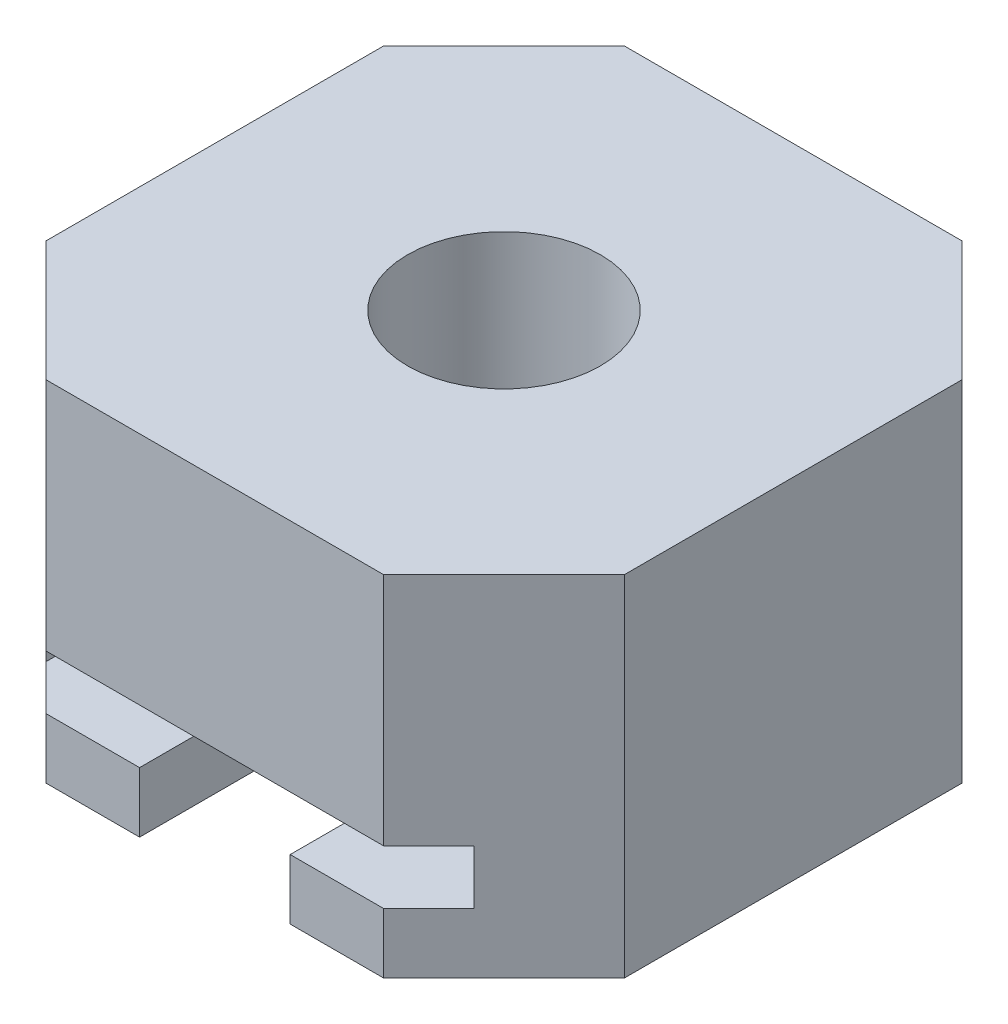
ISO-10303-21;
HEADER;
FILE_DESCRIPTION(('STEP AP214'),'2;1');
FILE_NAME('part.step','',(''),(''),'','','');
FILE_SCHEMA(('AUTOMOTIVE_DESIGN { 1 0 10303 214 1 1 1 1 }'));
ENDSEC;
DATA;
#1=APPLICATION_CONTEXT('core data for automotive mechanical design processes');
#2=APPLICATION_PROTOCOL_DEFINITION('international standard','automotive_design',2000,#1);
#3=PRODUCT_CONTEXT('',#1,'mechanical');
#4=PRODUCT('Part','Part','',(#3));
#5=PRODUCT_RELATED_PRODUCT_CATEGORY('part','',(#4));
#6=PRODUCT_DEFINITION_FORMATION('','',#4);
#7=PRODUCT_DEFINITION_CONTEXT('part definition',#1,'design');
#8=PRODUCT_DEFINITION('design','',#6,#7);
#9=PRODUCT_DEFINITION_SHAPE('','',#8);
#10=(LENGTH_UNIT() NAMED_UNIT(*) SI_UNIT(.MILLI.,.METRE.));
#11=(NAMED_UNIT(*) PLANE_ANGLE_UNIT() SI_UNIT($,.RADIAN.));
#12=(NAMED_UNIT(*) SI_UNIT($,.STERADIAN.) SOLID_ANGLE_UNIT());
#13=UNCERTAINTY_MEASURE_WITH_UNIT(LENGTH_MEASURE(1.E-05),#10,'distance_accuracy_value','');
#14=(GEOMETRIC_REPRESENTATION_CONTEXT(3) GLOBAL_UNCERTAINTY_ASSIGNED_CONTEXT((#13)) GLOBAL_UNIT_ASSIGNED_CONTEXT((#10,
#11,#12)) REPRESENTATION_CONTEXT('',''));
#15=CARTESIAN_POINT('',(0.,0.,0.));
#16=DIRECTION('',(0.,0.,1.));
#17=DIRECTION('',(1.,0.,0.));
#18=AXIS2_PLACEMENT_3D('',#15,#16,#17);
#19=CARTESIAN_POINT('',(-12.192,12.192,12.1919999999998));
#20=DIRECTION('',(0.,0.,-1.));
#21=DIRECTION('',(-1.,0.,0.));
#22=AXIS2_PLACEMENT_3D('',#19,#20,#21);
#23=PLANE('',#22);
#24=DIRECTION('',(1.,0.,0.));
#25=VECTOR('',#24,1.);
#26=CARTESIAN_POINT('',(-12.192,12.192,12.1919999999998));
#27=LINE('',#26,#25);
#28=CARTESIAN_POINT('',(-7.112,12.192,12.1919999999998));
#29=VERTEX_POINT('',#28);
#30=CARTESIAN_POINT('',(7.11199999999999,12.192,12.1919999999998));
#31=VERTEX_POINT('',#30);
#32=EDGE_CURVE('E227',#29,#31,#27,.T.);
#33=ORIENTED_EDGE('',*,*,#32,.F.);
#34=DIRECTION('',(0.,-1.,0.));
#35=VECTOR('',#34,1.);
#36=CARTESIAN_POINT('',(-7.112,12.192,12.1919999999998));
#37=LINE('',#36,#35);
#38=CARTESIAN_POINT('',(-7.112,2.286,12.1919999999998));
#39=VERTEX_POINT('',#38);
#40=EDGE_CURVE('E295',#29,#39,#37,.T.);
#41=ORIENTED_EDGE('',*,*,#40,.T.);
#42=DIRECTION('',(1.,0.,0.));
#43=VECTOR('',#42,1.);
#44=CARTESIAN_POINT('',(0.,2.286,12.1919999999998));
#45=LINE('',#44,#43);
#46=CARTESIAN_POINT('',(7.11199999999999,2.286,12.1919999999998));
#47=VERTEX_POINT('',#46);
#48=EDGE_CURVE('E374',#39,#47,#45,.T.);
#49=ORIENTED_EDGE('',*,*,#48,.T.);
#50=DIRECTION('',(0.,1.,0.));
#51=VECTOR('',#50,1.);
#52=CARTESIAN_POINT('',(7.11199999999999,12.192,12.1919999999998));
#53=LINE('',#52,#51);
#54=EDGE_CURVE('E286',#47,#31,#53,.T.);
#55=ORIENTED_EDGE('',*,*,#54,.T.);
#56=EDGE_LOOP('',(#33,#41,#49,#55));
#57=FACE_BOUND('',#56,.T.);
#58=ADVANCED_FACE('F43',(#57),#23,.F.);
#59=DIRECTION('',(-1.,0.,0.));
#60=VECTOR('',#59,1.);
#61=CARTESIAN_POINT('',(12.192,-2.54,12.1919999999998));
#62=LINE('',#61,#60);
#63=CARTESIAN_POINT('',(7.11199999999999,-2.54,12.1919999999998));
#64=VERTEX_POINT('',#63);
#65=CARTESIAN_POINT('',(3.175,-2.54,12.1919999999998));
#66=VERTEX_POINT('',#65);
#67=EDGE_CURVE('E346',#64,#66,#62,.T.);
#68=ORIENTED_EDGE('',*,*,#67,.F.);
#69=DIRECTION('',(0.,1.,0.));
#70=VECTOR('',#69,1.);
#71=CARTESIAN_POINT('',(7.11199999999999,12.192,12.1919999999998));
#72=LINE('',#71,#70);
#73=CARTESIAN_POINT('',(7.11199999999999,0.,12.1919999999998));
#74=VERTEX_POINT('',#73);
#75=EDGE_CURVE('E289',#64,#74,#72,.T.);
#76=ORIENTED_EDGE('',*,*,#75,.T.);
#77=DIRECTION('',(1.,0.,0.));
#78=VECTOR('',#77,1.);
#79=CARTESIAN_POINT('',(0.,0.,12.1919999999998));
#80=LINE('',#79,#78);
#81=CARTESIAN_POINT('',(3.175,0.,12.1919999999998));
#82=VERTEX_POINT('',#81);
#83=EDGE_CURVE('E326',#82,#74,#80,.T.);
#84=ORIENTED_EDGE('',*,*,#83,.F.);
#85=DIRECTION('',(0.,-1.,0.));
#86=VECTOR('',#85,1.);
#87=CARTESIAN_POINT('',(3.175,13.7465400737784,12.1919999999998));
#88=LINE('',#87,#86);
#89=EDGE_CURVE('E391',#82,#66,#88,.T.);
#90=ORIENTED_EDGE('',*,*,#89,.T.);
#91=EDGE_LOOP('',(#68,#76,#84,#90));
#92=FACE_BOUND('',#91,.T.);
#93=ADVANCED_FACE('F449',(#92),#23,.F.);
#94=CARTESIAN_POINT('',(-9.017,12.192,-6.096));
#95=DIRECTION('',(0.707106781186544,0.,0.707106781186551));
#96=DIRECTION('',(0.707106781186551,0.,-0.707106781186544));
#97=AXIS2_PLACEMENT_3D('',#94,#95,#96);
#98=PLANE('',#97);
#99=DIRECTION('',(0.,-1.,0.));
#100=VECTOR('',#99,1.);
#101=CARTESIAN_POINT('',(-6.0960000000002,12.192,-9.01699999999977));
#102=LINE('',#101,#100);
#103=CARTESIAN_POINT('',(-6.0960000000002,2.286,-9.01699999999977));
#104=VERTEX_POINT('',#103);
#105=CARTESIAN_POINT('',(-6.0960000000002,0.,-9.01699999999977));
#106=VERTEX_POINT('',#105);
#107=EDGE_CURVE('E216',#104,#106,#102,.T.);
#108=ORIENTED_EDGE('',*,*,#107,.F.);
#109=DIRECTION('',(-0.707106781186551,0.,0.707106781186544));
#110=VECTOR('',#109,1.);
#111=CARTESIAN_POINT('',(-9.017,2.286,-6.096));
#112=LINE('',#111,#110);
#113=CARTESIAN_POINT('',(-9.017,2.286,-6.096));
#114=VERTEX_POINT('',#113);
#115=EDGE_CURVE('E193',#104,#114,#112,.T.);
#116=ORIENTED_EDGE('',*,*,#115,.T.);
#117=DIRECTION('',(0.,-1.,0.));
#118=VECTOR('',#117,1.);
#119=CARTESIAN_POINT('',(-9.017,12.192,-6.096));
#120=LINE('',#119,#118);
#121=CARTESIAN_POINT('',(-9.017,0.,-6.096));
#122=VERTEX_POINT('',#121);
#123=EDGE_CURVE('E220',#114,#122,#120,.T.);
#124=ORIENTED_EDGE('',*,*,#123,.T.);
#125=DIRECTION('',(-0.707106781186551,0.,0.707106781186544));
#126=VECTOR('',#125,1.);
#127=CARTESIAN_POINT('',(-9.017,0.,-6.096));
#128=LINE('',#127,#126);
#129=EDGE_CURVE('E350',#106,#122,#128,.T.);
#130=ORIENTED_EDGE('',*,*,#129,.F.);
#131=EDGE_LOOP('',(#108,#116,#124,#130));
#132=FACE_BOUND('',#131,.T.);
#133=ADVANCED_FACE('F455',(#132),#98,.T.);
#134=CARTESIAN_POINT('',(-9.017,12.192,6.096));
#135=DIRECTION('',(1.,0.,0.));
#136=DIRECTION('',(0.,0.,-1.));
#137=AXIS2_PLACEMENT_3D('',#134,#135,#136);
#138=PLANE('',#137);
#139=DIRECTION('',(0.,0.,1.));
#140=VECTOR('',#139,1.);
#141=CARTESIAN_POINT('',(-9.017,2.286,0.));
#142=LINE('',#141,#140);
#143=CARTESIAN_POINT('',(-9.017,2.286,10.2869999999998));
#144=VERTEX_POINT('',#143);
#145=EDGE_CURVE('E371',#114,#144,#142,.T.);
#146=ORIENTED_EDGE('',*,*,#145,.T.);
#147=DIRECTION('',(0.,1.,0.));
#148=VECTOR('',#147,1.);
#149=CARTESIAN_POINT('',(-9.017,12.192,10.2869999999998));
#150=LINE('',#149,#148);
#151=CARTESIAN_POINT('',(-9.017,0.,10.2869999999998));
#152=VERTEX_POINT('',#151);
#153=EDGE_CURVE('E68',#144,#152,#150,.F.);
#154=ORIENTED_EDGE('',*,*,#153,.T.);
#155=DIRECTION('',(0.,0.,1.));
#156=VECTOR('',#155,1.);
#157=CARTESIAN_POINT('',(-9.017,0.,6.096));
#158=LINE('',#157,#156);
#159=EDGE_CURVE('E315',#122,#152,#158,.T.);
#160=ORIENTED_EDGE('',*,*,#159,.F.);
#161=ORIENTED_EDGE('',*,*,#123,.F.);
#162=EDGE_LOOP('',(#146,#154,#160,#161));
#163=FACE_BOUND('',#162,.T.);
#164=ADVANCED_FACE('F456',(#163),#138,.T.);
#165=CARTESIAN_POINT('',(9.017,12.192,-6.096));
#166=DIRECTION('',(-1.,0.,0.));
#167=DIRECTION('',(0.,0.,1.));
#168=AXIS2_PLACEMENT_3D('',#165,#166,#167);
#169=PLANE('',#168);
#170=DIRECTION('',(0.,0.,-1.));
#171=VECTOR('',#170,1.);
#172=CARTESIAN_POINT('',(9.017,0.,-6.096));
#173=LINE('',#172,#171);
#174=CARTESIAN_POINT('',(9.017,0.,10.2869999999998));
#175=VERTEX_POINT('',#174);
#176=CARTESIAN_POINT('',(9.017,0.,-6.096));
#177=VERTEX_POINT('',#176);
#178=EDGE_CURVE('E359',#175,#177,#173,.T.);
#179=ORIENTED_EDGE('',*,*,#178,.F.);
#180=DIRECTION('',(0.,-1.,0.));
#181=VECTOR('',#180,1.);
#182=CARTESIAN_POINT('',(9.017,12.192,10.2869999999998));
#183=LINE('',#182,#181);
#184=CARTESIAN_POINT('',(9.017,2.286,10.2869999999998));
#185=VERTEX_POINT('',#184);
#186=EDGE_CURVE('E11',#175,#185,#183,.F.);
#187=ORIENTED_EDGE('',*,*,#186,.T.);
#188=DIRECTION('',(0.,0.,1.));
#189=VECTOR('',#188,1.);
#190=CARTESIAN_POINT('',(9.017,2.286,0.));
#191=LINE('',#190,#189);
#192=CARTESIAN_POINT('',(9.017,2.286,-6.096));
#193=VERTEX_POINT('',#192);
#194=EDGE_CURVE('E325',#193,#185,#191,.T.);
#195=ORIENTED_EDGE('',*,*,#194,.F.);
#196=DIRECTION('',(0.,-1.,0.));
#197=VECTOR('',#196,1.);
#198=CARTESIAN_POINT('',(9.017,12.192,-6.096));
#199=LINE('',#198,#197);
#200=EDGE_CURVE('E207',#193,#177,#199,.T.);
#201=ORIENTED_EDGE('',*,*,#200,.T.);
#202=EDGE_LOOP('',(#179,#187,#195,#201));
#203=FACE_BOUND('',#202,.T.);
#204=ADVANCED_FACE('F368',(#203),#169,.T.);
#205=CARTESIAN_POINT('',(6.096,12.192,-9.01699999999976));
#206=DIRECTION('',(-0.707106781186519,0.,0.707106781186576));
#207=DIRECTION('',(0.707106781186576,0.,0.707106781186519));
#208=AXIS2_PLACEMENT_3D('',#205,#206,#207);
#209=PLANE('',#208);
#210=ORIENTED_EDGE('',*,*,#200,.F.);
#211=DIRECTION('',(-0.707106781186576,0.,-0.707106781186519));
#212=VECTOR('',#211,1.);
#213=CARTESIAN_POINT('',(6.096,2.286,-9.01699999999976));
#214=LINE('',#213,#212);
#215=CARTESIAN_POINT('',(6.096,2.286,-9.01699999999976));
#216=VERTEX_POINT('',#215);
#217=EDGE_CURVE('E190',#193,#216,#214,.T.);
#218=ORIENTED_EDGE('',*,*,#217,.T.);
#219=DIRECTION('',(0.,-1.,0.));
#220=VECTOR('',#219,1.);
#221=CARTESIAN_POINT('',(6.096,12.192,-9.01699999999976));
#222=LINE('',#221,#220);
#223=CARTESIAN_POINT('',(6.096,0.,-9.01699999999976));
#224=VERTEX_POINT('',#223);
#225=EDGE_CURVE('E204',#216,#224,#222,.T.);
#226=ORIENTED_EDGE('',*,*,#225,.T.);
#227=DIRECTION('',(-0.707106781186576,0.,-0.707106781186519));
#228=VECTOR('',#227,1.);
#229=CARTESIAN_POINT('',(6.096,0.,-9.01699999999976));
#230=LINE('',#229,#228);
#231=EDGE_CURVE('E362',#177,#224,#230,.T.);
#232=ORIENTED_EDGE('',*,*,#231,.F.);
#233=EDGE_LOOP('',(#210,#218,#226,#232));
#234=FACE_BOUND('',#233,.T.);
#235=ADVANCED_FACE('F202',(#234),#209,.T.);
#236=CARTESIAN_POINT('',(-6.0960000000002,12.192,-9.01699999999977));
#237=DIRECTION('',(0.,0.,1.));
#238=DIRECTION('',(1.,0.,0.));
#239=AXIS2_PLACEMENT_3D('',#236,#237,#238);
#240=PLANE('',#239);
#241=ORIENTED_EDGE('',*,*,#225,.F.);
#242=DIRECTION('',(-1.,0.,0.));
#243=VECTOR('',#242,1.);
#244=CARTESIAN_POINT('',(-6.0960000000002,2.286,-9.01699999999977));
#245=LINE('',#244,#243);
#246=EDGE_CURVE('E184',#216,#104,#245,.T.);
#247=ORIENTED_EDGE('',*,*,#246,.T.);
#248=ORIENTED_EDGE('',*,*,#107,.T.);
#249=DIRECTION('',(-1.,0.,0.));
#250=VECTOR('',#249,1.);
#251=CARTESIAN_POINT('',(-6.0960000000002,0.,-9.01699999999977));
#252=LINE('',#251,#250);
#253=EDGE_CURVE('E213',#224,#106,#252,.T.);
#254=ORIENTED_EDGE('',*,*,#253,.F.);
#255=EDGE_LOOP('',(#241,#247,#248,#254));
#256=FACE_BOUND('',#255,.T.);
#257=ADVANCED_FACE('F211',(#256),#240,.T.);
#258=CARTESIAN_POINT('',(-7.112,0.,12.1919999999998));
#259=VERTEX_POINT('',#258);
#260=CARTESIAN_POINT('',(-3.175,0.,12.1919999999998));
#261=VERTEX_POINT('',#260);
#262=EDGE_CURVE('E312',#259,#261,#80,.T.);
#263=ORIENTED_EDGE('',*,*,#262,.F.);
#264=DIRECTION('',(0.,-1.,0.));
#265=VECTOR('',#264,1.);
#266=CARTESIAN_POINT('',(-7.112,12.192,12.1919999999998));
#267=LINE('',#266,#265);
#268=CARTESIAN_POINT('',(-7.112,-2.54,12.1919999999998));
#269=VERTEX_POINT('',#268);
#270=EDGE_CURVE('E292',#259,#269,#267,.T.);
#271=ORIENTED_EDGE('',*,*,#270,.T.);
#272=CARTESIAN_POINT('',(-3.175,-2.54,12.1919999999998));
#273=VERTEX_POINT('',#272);
#274=EDGE_CURVE('E339',#273,#269,#62,.T.);
#275=ORIENTED_EDGE('',*,*,#274,.F.);
#276=DIRECTION('',(0.,-1.,0.));
#277=VECTOR('',#276,1.);
#278=CARTESIAN_POINT('',(-3.175,13.7465400737784,12.1919999999998));
#279=LINE('',#278,#277);
#280=EDGE_CURVE('E323',#261,#273,#279,.T.);
#281=ORIENTED_EDGE('',*,*,#280,.F.);
#282=EDGE_LOOP('',(#263,#271,#275,#281));
#283=FACE_BOUND('',#282,.T.);
#284=ADVANCED_FACE('F320',(#283),#23,.F.);
#285=CARTESIAN_POINT('',(0.,12.192,0.));
#286=DIRECTION('',(0.,1.,0.));
#287=DIRECTION('',(0.,0.,1.));
#288=AXIS2_PLACEMENT_3D('',#285,#286,#287);
#289=PLANE('',#288);
#290=DIRECTION('',(0.,0.,-1.));
#291=VECTOR('',#290,1.);
#292=CARTESIAN_POINT('',(12.192,12.192,12.1919999999998));
#293=LINE('',#292,#291);
#294=CARTESIAN_POINT('',(12.192,12.192,7.11199999999979));
#295=VERTEX_POINT('',#294);
#296=CARTESIAN_POINT('',(12.192,12.192,-7.11199999999981));
#297=VERTEX_POINT('',#296);
#298=EDGE_CURVE('E231',#295,#297,#293,.T.);
#299=ORIENTED_EDGE('',*,*,#298,.T.);
#300=DIRECTION('',(0.707106781186546,0.,0.707106781186549));
#301=VECTOR('',#300,1.);
#302=CARTESIAN_POINT('',(9.65199999999993,12.192,-9.65199999999989));
#303=LINE('',#302,#301);
#304=CARTESIAN_POINT('',(7.112,12.192,-12.1919999999998));
#305=VERTEX_POINT('',#304);
#306=EDGE_CURVE('E276',#297,#305,#303,.F.);
#307=ORIENTED_EDGE('',*,*,#306,.T.);
#308=DIRECTION('',(-1.,0.,0.));
#309=VECTOR('',#308,1.);
#310=CARTESIAN_POINT('',(12.192,12.192,-12.1919999999998));
#311=LINE('',#310,#309);
#312=CARTESIAN_POINT('',(-7.11199999999998,12.192,-12.1919999999999));
#313=VERTEX_POINT('',#312);
#314=EDGE_CURVE('E235',#305,#313,#311,.T.);
#315=ORIENTED_EDGE('',*,*,#314,.T.);
#316=DIRECTION('',(0.70710678118655,0.,-0.707106781186545));
#317=VECTOR('',#316,1.);
#318=CARTESIAN_POINT('',(-9.6519999999999,12.192,-9.65199999999998));
#319=LINE('',#318,#317);
#320=CARTESIAN_POINT('',(-12.192,12.192,-7.1119999999999));
#321=VERTEX_POINT('',#320);
#322=EDGE_CURVE('E273',#313,#321,#319,.F.);
#323=ORIENTED_EDGE('',*,*,#322,.T.);
#324=DIRECTION('',(0.,0.,1.));
#325=VECTOR('',#324,1.);
#326=CARTESIAN_POINT('',(-12.192,12.192,-12.1919999999999));
#327=LINE('',#326,#325);
#328=CARTESIAN_POINT('',(-12.192,12.192,7.11199999999977));
#329=VERTEX_POINT('',#328);
#330=EDGE_CURVE('E199',#321,#329,#327,.T.);
#331=ORIENTED_EDGE('',*,*,#330,.T.);
#332=DIRECTION('',(-0.707106781186547,0.,-0.707106781186549));
#333=VECTOR('',#332,1.);
#334=CARTESIAN_POINT('',(-9.6519999999999,12.192,9.65199999999987));
#335=LINE('',#334,#333);
#336=EDGE_CURVE('E270',#329,#29,#335,.F.);
#337=ORIENTED_EDGE('',*,*,#336,.T.);
#338=ORIENTED_EDGE('',*,*,#32,.T.);
#339=DIRECTION('',(-0.707106781186549,0.,0.707106781186546));
#340=VECTOR('',#339,1.);
#341=CARTESIAN_POINT('',(9.65199999999988,12.192,9.65199999999991));
#342=LINE('',#341,#340);
#343=EDGE_CURVE('E267',#31,#295,#342,.F.);
#344=ORIENTED_EDGE('',*,*,#343,.T.);
#345=EDGE_LOOP('',(#299,#307,#315,#323,#331,#337,#338,#344));
#346=FACE_BOUND('',#345,.T.);
#347=CARTESIAN_POINT('',(0.,12.192,0.));
#348=DIRECTION('',(0.,1.,0.));
#349=DIRECTION('',(0.,0.,1.));
#350=AXIS2_PLACEMENT_3D('',#347,#348,#349);
#351=CIRCLE('',#350,4.064);
#352=CARTESIAN_POINT('',(0.,12.192,4.06399999999999));
#353=VERTEX_POINT('',#352);
#354=EDGE_CURVE('E513',#353,#353,#351,.T.);
#355=ORIENTED_EDGE('',*,*,#354,.F.);
#356=EDGE_LOOP('',(#355));
#357=FACE_BOUND('',#356,.T.);
#358=ADVANCED_FACE('F431',(#346,#357),#289,.T.);
#359=CARTESIAN_POINT('',(12.192,12.192,12.1919999999998));
#360=DIRECTION('',(-1.,0.,0.));
#361=DIRECTION('',(0.,0.,1.));
#362=AXIS2_PLACEMENT_3D('',#359,#360,#361);
#363=PLANE('',#362);
#364=DIRECTION('',(0.,0.,1.));
#365=VECTOR('',#364,1.);
#366=CARTESIAN_POINT('',(12.192,-2.54,12.1919999999998));
#367=LINE('',#366,#365);
#368=CARTESIAN_POINT('',(12.192,-2.54,-7.11199999999981));
#369=VERTEX_POINT('',#368);
#370=CARTESIAN_POINT('',(12.192,-2.54,7.11199999999979));
#371=VERTEX_POINT('',#370);
#372=EDGE_CURVE('E412',#369,#371,#367,.T.);
#373=ORIENTED_EDGE('',*,*,#372,.F.);
#374=DIRECTION('',(0.,1.,0.));
#375=VECTOR('',#374,1.);
#376=CARTESIAN_POINT('',(12.192,12.192,-7.11199999999981));
#377=LINE('',#376,#375);
#378=EDGE_CURVE('E264',#369,#297,#377,.T.);
#379=ORIENTED_EDGE('',*,*,#378,.T.);
#380=ORIENTED_EDGE('',*,*,#298,.F.);
#381=DIRECTION('',(0.,-1.,0.));
#382=VECTOR('',#381,1.);
#383=CARTESIAN_POINT('',(12.192,12.192,7.11199999999979));
#384=LINE('',#383,#382);
#385=EDGE_CURVE('E260',#295,#371,#384,.T.);
#386=ORIENTED_EDGE('',*,*,#385,.T.);
#387=EDGE_LOOP('',(#373,#379,#380,#386));
#388=FACE_BOUND('',#387,.T.);
#389=ADVANCED_FACE('F422',(#388),#363,.F.);
#390=CARTESIAN_POINT('',(12.192,12.192,-12.1919999999998));
#391=DIRECTION('',(0.,0.,1.));
#392=DIRECTION('',(1.,0.,0.));
#393=AXIS2_PLACEMENT_3D('',#390,#391,#392);
#394=PLANE('',#393);
#395=ORIENTED_EDGE('',*,*,#314,.F.);
#396=DIRECTION('',(0.,-1.,0.));
#397=VECTOR('',#396,1.);
#398=CARTESIAN_POINT('',(7.112,12.192,-12.1919999999998));
#399=LINE('',#398,#397);
#400=CARTESIAN_POINT('',(7.112,-2.54,-12.1919999999999));
#401=VERTEX_POINT('',#400);
#402=EDGE_CURVE('E244',#305,#401,#399,.T.);
#403=ORIENTED_EDGE('',*,*,#402,.T.);
#404=DIRECTION('',(1.,0.,0.));
#405=VECTOR('',#404,1.);
#406=CARTESIAN_POINT('',(12.192,-2.54,-12.1919999999999));
#407=LINE('',#406,#405);
#408=CARTESIAN_POINT('',(-7.11199999999999,-2.54,-12.1919999999999));
#409=VERTEX_POINT('',#408);
#410=EDGE_CURVE('E345',#409,#401,#407,.T.);
#411=ORIENTED_EDGE('',*,*,#410,.F.);
#412=DIRECTION('',(0.,1.,0.));
#413=VECTOR('',#412,1.);
#414=CARTESIAN_POINT('',(-7.11199999999999,12.192,-12.1919999999999));
#415=LINE('',#414,#413);
#416=EDGE_CURVE('E198',#409,#313,#415,.T.);
#417=ORIENTED_EDGE('',*,*,#416,.T.);
#418=EDGE_LOOP('',(#395,#403,#411,#417));
#419=FACE_BOUND('',#418,.T.);
#420=ADVANCED_FACE('F435',(#419),#394,.F.);
#421=CARTESIAN_POINT('',(-12.192,12.192,-12.1919999999999));
#422=DIRECTION('',(1.,0.,0.));
#423=DIRECTION('',(0.,0.,-1.));
#424=AXIS2_PLACEMENT_3D('',#421,#422,#423);
#425=PLANE('',#424);
#426=ORIENTED_EDGE('',*,*,#330,.F.);
#427=DIRECTION('',(0.,-1.,0.));
#428=VECTOR('',#427,1.);
#429=CARTESIAN_POINT('',(-12.192,12.192,-7.1119999999999));
#430=LINE('',#429,#428);
#431=CARTESIAN_POINT('',(-12.192,-2.54,-7.1119999999999));
#432=VERTEX_POINT('',#431);
#433=EDGE_CURVE('E282',#321,#432,#430,.T.);
#434=ORIENTED_EDGE('',*,*,#433,.T.);
#435=DIRECTION('',(0.,0.,-1.));
#436=VECTOR('',#435,1.);
#437=CARTESIAN_POINT('',(-12.192,-2.54,12.1919999999998));
#438=LINE('',#437,#436);
#439=CARTESIAN_POINT('',(-12.192,-2.54,7.11199999999977));
#440=VERTEX_POINT('',#439);
#441=EDGE_CURVE('E337',#440,#432,#438,.T.);
#442=ORIENTED_EDGE('',*,*,#441,.F.);
#443=DIRECTION('',(0.,1.,0.));
#444=VECTOR('',#443,1.);
#445=CARTESIAN_POINT('',(-12.192,12.192,7.11199999999977));
#446=LINE('',#445,#444);
#447=EDGE_CURVE('E279',#440,#329,#446,.T.);
#448=ORIENTED_EDGE('',*,*,#447,.T.);
#449=EDGE_LOOP('',(#426,#434,#442,#448));
#450=FACE_BOUND('',#449,.T.);
#451=ADVANCED_FACE('F342',(#450),#425,.F.);
#452=CARTESIAN_POINT('',(0.,-2.54,0.));
#453=DIRECTION('',(0.,1.,0.));
#454=DIRECTION('',(0.,0.,1.));
#455=AXIS2_PLACEMENT_3D('',#452,#453,#454);
#456=PLANE('',#455);
#457=ORIENTED_EDGE('',*,*,#410,.T.);
#458=DIRECTION('',(-0.707106781186546,0.,-0.707106781186549));
#459=VECTOR('',#458,1.);
#460=CARTESIAN_POINT('',(7.112,-2.54,-12.1919999999998));
#461=LINE('',#460,#459);
#462=EDGE_CURVE('E257',#401,#369,#461,.F.);
#463=ORIENTED_EDGE('',*,*,#462,.T.);
#464=ORIENTED_EDGE('',*,*,#372,.T.);
#465=DIRECTION('',(0.707106781186549,0.,-0.707106781186546));
#466=VECTOR('',#465,1.);
#467=CARTESIAN_POINT('',(12.192,-2.54,7.11199999999979));
#468=LINE('',#467,#466);
#469=EDGE_CURVE('E248',#371,#64,#468,.F.);
#470=ORIENTED_EDGE('',*,*,#469,.T.);
#471=ORIENTED_EDGE('',*,*,#67,.T.);
#472=DIRECTION('',(0.,0.,1.));
#473=VECTOR('',#472,1.);
#474=CARTESIAN_POINT('',(3.175,-2.54,0.));
#475=LINE('',#474,#473);
#476=CARTESIAN_POINT('',(3.175,-2.54,0.));
#477=VERTEX_POINT('',#476);
#478=EDGE_CURVE('E380',#477,#66,#475,.T.);
#479=ORIENTED_EDGE('',*,*,#478,.F.);
#480=CARTESIAN_POINT('',(0.,-2.54,0.));
#481=DIRECTION('',(0.,-1.,0.));
#482=DIRECTION('',(0.,0.,-1.));
#483=AXIS2_PLACEMENT_3D('',#480,#481,#482);
#484=CIRCLE('',#483,3.175);
#485=CARTESIAN_POINT('',(-3.175,-2.54,0.));
#486=VERTEX_POINT('',#485);
#487=EDGE_CURVE('E408',#486,#477,#484,.T.);
#488=ORIENTED_EDGE('',*,*,#487,.F.);
#489=DIRECTION('',(0.,0.,-1.));
#490=VECTOR('',#489,1.);
#491=CARTESIAN_POINT('',(-3.175,-2.54,0.));
#492=LINE('',#491,#490);
#493=EDGE_CURVE('E382',#273,#486,#492,.T.);
#494=ORIENTED_EDGE('',*,*,#493,.F.);
#495=ORIENTED_EDGE('',*,*,#274,.T.);
#496=DIRECTION('',(0.707106781186547,0.,0.707106781186549));
#497=VECTOR('',#496,1.);
#498=CARTESIAN_POINT('',(-7.112,-2.54,12.1919999999998));
#499=LINE('',#498,#497);
#500=EDGE_CURVE('E251',#269,#440,#499,.F.);
#501=ORIENTED_EDGE('',*,*,#500,.T.);
#502=ORIENTED_EDGE('',*,*,#441,.T.);
#503=DIRECTION('',(-0.70710678118655,0.,0.707106781186545));
#504=VECTOR('',#503,1.);
#505=CARTESIAN_POINT('',(-12.192,-2.54,-7.1119999999999));
#506=LINE('',#505,#504);
#507=EDGE_CURVE('E254',#432,#409,#506,.F.);
#508=ORIENTED_EDGE('',*,*,#507,.T.);
#509=EDGE_LOOP('',(#457,#463,#464,#470,#471,#479,#488,#494,#495,#501,#502,#508));
#510=FACE_BOUND('',#509,.T.);
#511=ADVANCED_FACE('F336',(#510),#456,.F.);
#512=CARTESIAN_POINT('',(0.,0.,0.));
#513=DIRECTION('',(0.,1.,0.));
#514=DIRECTION('',(0.,0.,1.));
#515=AXIS2_PLACEMENT_3D('',#512,#513,#514);
#516=PLANE('',#515);
#517=ORIENTED_EDGE('',*,*,#159,.T.);
#518=DIRECTION('',(-0.707106781186547,0.,-0.707106781186549));
#519=VECTOR('',#518,1.);
#520=CARTESIAN_POINT('',(-9.6519999999999,0.,9.65199999999987));
#521=LINE('',#520,#519);
#522=EDGE_CURVE('E53',#152,#259,#521,.F.);
#523=ORIENTED_EDGE('',*,*,#522,.T.);
#524=ORIENTED_EDGE('',*,*,#262,.T.);
#525=DIRECTION('',(0.,0.,-1.));
#526=VECTOR('',#525,1.);
#527=CARTESIAN_POINT('',(-3.175,0.,0.));
#528=LINE('',#527,#526);
#529=CARTESIAN_POINT('',(-3.175,0.,0.));
#530=VERTEX_POINT('',#529);
#531=EDGE_CURVE('E393',#261,#530,#528,.T.);
#532=ORIENTED_EDGE('',*,*,#531,.T.);
#533=CARTESIAN_POINT('',(0.,0.,0.));
#534=DIRECTION('',(0.,-1.,0.));
#535=DIRECTION('',(0.,0.,-1.));
#536=AXIS2_PLACEMENT_3D('',#533,#534,#535);
#537=CIRCLE('',#536,3.175);
#538=CARTESIAN_POINT('',(3.175,0.,0.));
#539=VERTEX_POINT('',#538);
#540=EDGE_CURVE('E407',#530,#539,#537,.T.);
#541=ORIENTED_EDGE('',*,*,#540,.T.);
#542=DIRECTION('',(0.,0.,1.));
#543=VECTOR('',#542,1.);
#544=CARTESIAN_POINT('',(3.175,0.,0.));
#545=LINE('',#544,#543);
#546=EDGE_CURVE('E388',#539,#82,#545,.T.);
#547=ORIENTED_EDGE('',*,*,#546,.T.);
#548=ORIENTED_EDGE('',*,*,#83,.T.);
#549=DIRECTION('',(-0.707106781186549,0.,0.707106781186546));
#550=VECTOR('',#549,1.);
#551=CARTESIAN_POINT('',(9.65199999999988,0.,9.65199999999991));
#552=LINE('',#551,#550);
#553=EDGE_CURVE('E60',#74,#175,#552,.F.);
#554=ORIENTED_EDGE('',*,*,#553,.T.);
#555=ORIENTED_EDGE('',*,*,#178,.T.);
#556=ORIENTED_EDGE('',*,*,#231,.T.);
#557=ORIENTED_EDGE('',*,*,#253,.T.);
#558=ORIENTED_EDGE('',*,*,#129,.T.);
#559=EDGE_LOOP('',(#517,#523,#524,#532,#541,#547,#548,#554,#555,#556,#557,#558));
#560=FACE_BOUND('',#559,.T.);
#561=ADVANCED_FACE('F311',(#560),#516,.T.);
#562=CARTESIAN_POINT('',(0.,-2.54,0.));
#563=DIRECTION('',(0.,1.,0.));
#564=DIRECTION('',(0.,0.,1.));
#565=AXIS2_PLACEMENT_3D('',#562,#563,#564);
#566=CYLINDRICAL_SURFACE('',#565,3.175);
#567=DIRECTION('',(0.,-1.,0.));
#568=VECTOR('',#567,1.);
#569=CARTESIAN_POINT('',(-3.175,13.7465400737784,0.));
#570=LINE('',#569,#568);
#571=EDGE_CURVE('E396',#530,#486,#570,.T.);
#572=ORIENTED_EDGE('',*,*,#571,.T.);
#573=ORIENTED_EDGE('',*,*,#487,.T.);
#574=DIRECTION('',(0.,-1.,0.));
#575=VECTOR('',#574,1.);
#576=CARTESIAN_POINT('',(3.175,13.7465400737784,0.));
#577=LINE('',#576,#575);
#578=EDGE_CURVE('E392',#539,#477,#577,.T.);
#579=ORIENTED_EDGE('',*,*,#578,.F.);
#580=ORIENTED_EDGE('',*,*,#540,.F.);
#581=EDGE_LOOP('',(#572,#573,#579,#580));
#582=FACE_BOUND('',#581,.T.);
#583=ADVANCED_FACE('F486',(#582),#566,.F.);
#584=CARTESIAN_POINT('',(-3.175,13.7465400737784,0.));
#585=DIRECTION('',(-1.,0.,0.));
#586=DIRECTION('',(0.,0.,1.));
#587=AXIS2_PLACEMENT_3D('',#584,#585,#586);
#588=PLANE('',#587);
#589=ORIENTED_EDGE('',*,*,#280,.T.);
#590=ORIENTED_EDGE('',*,*,#493,.T.);
#591=ORIENTED_EDGE('',*,*,#571,.F.);
#592=ORIENTED_EDGE('',*,*,#531,.F.);
#593=EDGE_LOOP('',(#589,#590,#591,#592));
#594=FACE_BOUND('',#593,.T.);
#595=ADVANCED_FACE('F491',(#594),#588,.F.);
#596=CARTESIAN_POINT('',(3.175,13.7465400737784,0.));
#597=DIRECTION('',(1.,0.,0.));
#598=DIRECTION('',(0.,0.,-1.));
#599=AXIS2_PLACEMENT_3D('',#596,#597,#598);
#600=PLANE('',#599);
#601=ORIENTED_EDGE('',*,*,#578,.T.);
#602=ORIENTED_EDGE('',*,*,#478,.T.);
#603=ORIENTED_EDGE('',*,*,#89,.F.);
#604=ORIENTED_EDGE('',*,*,#546,.F.);
#605=EDGE_LOOP('',(#601,#602,#603,#604));
#606=FACE_BOUND('',#605,.T.);
#607=ADVANCED_FACE('F495',(#606),#600,.F.);
#608=CARTESIAN_POINT('',(0.,2.286,0.));
#609=DIRECTION('',(0.,1.,0.));
#610=DIRECTION('',(0.,0.,1.));
#611=AXIS2_PLACEMENT_3D('',#608,#609,#610);
#612=PLANE('',#611);
#613=ORIENTED_EDGE('',*,*,#48,.F.);
#614=DIRECTION('',(0.707106781186547,0.,0.707106781186549));
#615=VECTOR('',#614,1.);
#616=CARTESIAN_POINT('',(-7.112,2.286,12.1919999999998));
#617=LINE('',#616,#615);
#618=EDGE_CURVE('E302',#39,#144,#617,.F.);
#619=ORIENTED_EDGE('',*,*,#618,.T.);
#620=ORIENTED_EDGE('',*,*,#145,.F.);
#621=ORIENTED_EDGE('',*,*,#115,.F.);
#622=ORIENTED_EDGE('',*,*,#246,.F.);
#623=ORIENTED_EDGE('',*,*,#217,.F.);
#624=ORIENTED_EDGE('',*,*,#194,.T.);
#625=DIRECTION('',(0.707106781186549,0.,-0.707106781186546));
#626=VECTOR('',#625,1.);
#627=CARTESIAN_POINT('',(12.192,2.286,7.11199999999979));
#628=LINE('',#627,#626);
#629=EDGE_CURVE('E299',#185,#47,#628,.F.);
#630=ORIENTED_EDGE('',*,*,#629,.T.);
#631=EDGE_LOOP('',(#613,#619,#620,#621,#622,#623,#624,#630));
#632=FACE_BOUND('',#631,.T.);
#633=CARTESIAN_POINT('',(0.,2.286,0.));
#634=DIRECTION('',(0.,1.,0.));
#635=DIRECTION('',(0.,0.,1.));
#636=AXIS2_PLACEMENT_3D('',#633,#634,#635);
#637=CIRCLE('',#636,4.064);
#638=CARTESIAN_POINT('',(0.,2.286,4.06399999999999));
#639=VERTEX_POINT('',#638);
#640=EDGE_CURVE('E209',#639,#639,#637,.F.);
#641=ORIENTED_EDGE('',*,*,#640,.F.);
#642=EDGE_LOOP('',(#641));
#643=FACE_BOUND('',#642,.T.);
#644=ADVANCED_FACE('F187',(#632,#643),#612,.F.);
#645=CARTESIAN_POINT('',(0.,-32.1981835049052,0.));
#646=DIRECTION('',(0.,1.,0.));
#647=DIRECTION('',(0.,0.,1.));
#648=AXIS2_PLACEMENT_3D('',#645,#646,#647);
#649=CYLINDRICAL_SURFACE('',#648,4.064);
#650=ORIENTED_EDGE('',*,*,#640,.T.);
#651=EDGE_LOOP('',(#650));
#652=FACE_BOUND('',#651,.T.);
#653=ORIENTED_EDGE('',*,*,#354,.T.);
#654=EDGE_LOOP('',(#653));
#655=FACE_BOUND('',#654,.T.);
#656=ADVANCED_FACE('F502',(#652,#655),#649,.F.);
#657=CARTESIAN_POINT('',(7.112,12.192,-12.1919999999998));
#658=DIRECTION('',(-0.707106781186549,0.,0.707106781186546));
#659=DIRECTION('',(0.,-1.,0.));
#660=AXIS2_PLACEMENT_3D('',#657,#658,#659);
#661=PLANE('',#660);
#662=ORIENTED_EDGE('',*,*,#306,.F.);
#663=ORIENTED_EDGE('',*,*,#378,.F.);
#664=ORIENTED_EDGE('',*,*,#462,.F.);
#665=ORIENTED_EDGE('',*,*,#402,.F.);
#666=EDGE_LOOP('',(#662,#663,#664,#665));
#667=FACE_BOUND('',#666,.T.);
#668=ADVANCED_FACE('F427',(#667),#661,.F.);
#669=CARTESIAN_POINT('',(-12.192,12.192,-7.1119999999999));
#670=DIRECTION('',(0.707106781186544,0.,0.70710678118655));
#671=DIRECTION('',(0.,-1.,0.));
#672=AXIS2_PLACEMENT_3D('',#669,#670,#671);
#673=PLANE('',#672);
#674=ORIENTED_EDGE('',*,*,#322,.F.);
#675=ORIENTED_EDGE('',*,*,#416,.F.);
#676=ORIENTED_EDGE('',*,*,#507,.F.);
#677=ORIENTED_EDGE('',*,*,#433,.F.);
#678=EDGE_LOOP('',(#674,#675,#676,#677));
#679=FACE_BOUND('',#678,.T.);
#680=ADVANCED_FACE('F439',(#679),#673,.F.);
#681=CARTESIAN_POINT('',(-7.112,12.192,12.1919999999998));
#682=DIRECTION('',(0.707106781186549,0.,-0.707106781186547));
#683=DIRECTION('',(0.,-1.,0.));
#684=AXIS2_PLACEMENT_3D('',#681,#682,#683);
#685=PLANE('',#684);
#686=ORIENTED_EDGE('',*,*,#336,.F.);
#687=ORIENTED_EDGE('',*,*,#447,.F.);
#688=ORIENTED_EDGE('',*,*,#500,.F.);
#689=ORIENTED_EDGE('',*,*,#270,.F.);
#690=ORIENTED_EDGE('',*,*,#522,.F.);
#691=ORIENTED_EDGE('',*,*,#153,.F.);
#692=ORIENTED_EDGE('',*,*,#618,.F.);
#693=ORIENTED_EDGE('',*,*,#40,.F.);
#694=EDGE_LOOP('',(#686,#687,#688,#689,#690,#691,#692,#693));
#695=FACE_BOUND('',#694,.T.);
#696=ADVANCED_FACE('F330',(#695),#685,.F.);
#697=CARTESIAN_POINT('',(12.192,12.192,7.11199999999979));
#698=DIRECTION('',(-0.707106781186546,0.,-0.707106781186549));
#699=DIRECTION('',(0.,-1.,0.));
#700=AXIS2_PLACEMENT_3D('',#697,#698,#699);
#701=PLANE('',#700);
#702=ORIENTED_EDGE('',*,*,#553,.F.);
#703=ORIENTED_EDGE('',*,*,#75,.F.);
#704=ORIENTED_EDGE('',*,*,#469,.F.);
#705=ORIENTED_EDGE('',*,*,#385,.F.);
#706=ORIENTED_EDGE('',*,*,#343,.F.);
#707=ORIENTED_EDGE('',*,*,#54,.F.);
#708=ORIENTED_EDGE('',*,*,#629,.F.);
#709=ORIENTED_EDGE('',*,*,#186,.F.);
#710=EDGE_LOOP('',(#702,#703,#704,#705,#706,#707,#708,#709));
#711=FACE_BOUND('',#710,.T.);
#712=ADVANCED_FACE('F46',(#711),#701,.F.);
#713=CLOSED_SHELL('',(#58,#93,#133,#164,#204,#235,#257,#284,#358,#389,#420,#451,#511,#561,#583,
#595,#607,#644,#656,#668,#680,#696,#712));
#714=MANIFOLD_SOLID_BREP('B2',#713);
#715=ADVANCED_BREP_SHAPE_REPRESENTATION('',(#18,#714),#14);
#716=SHAPE_DEFINITION_REPRESENTATION(#9,#715);
ENDSEC;
END-ISO-10303-21;
